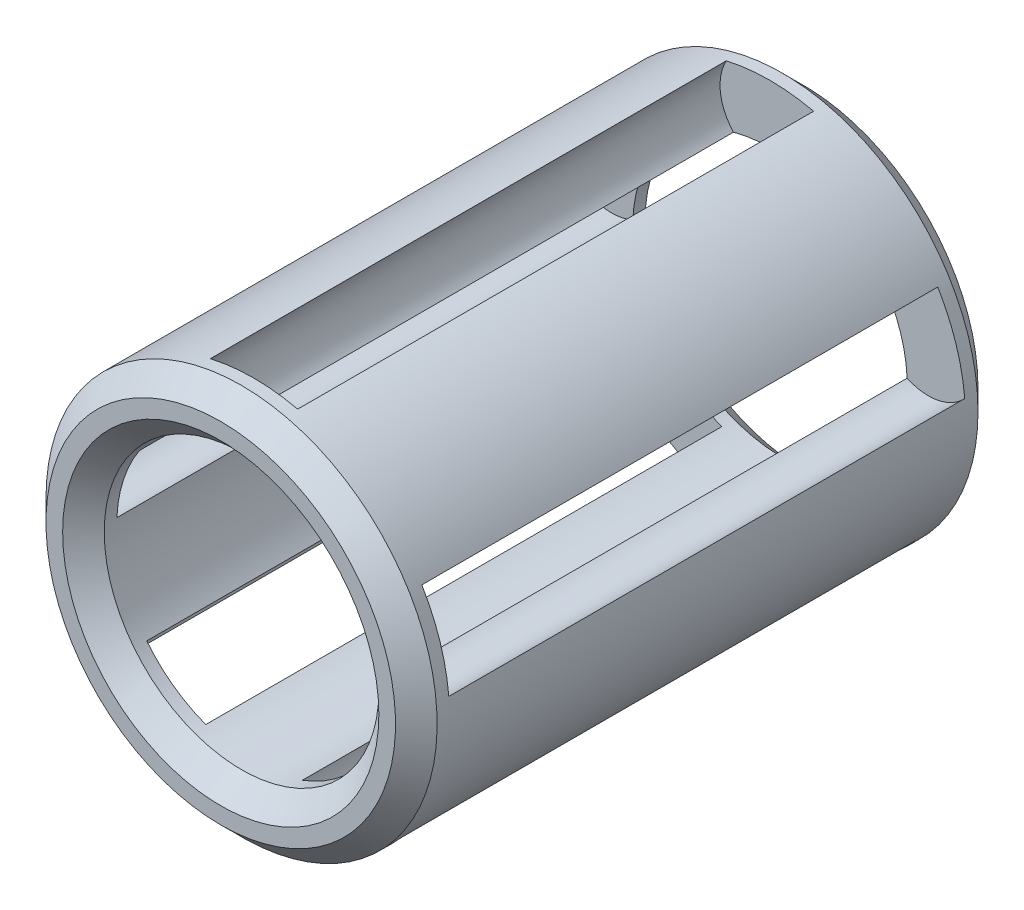
ISO-10303-21;
HEADER;
FILE_DESCRIPTION(('STEP AP214'),'2;1');
FILE_NAME('part.step','',(''),(''),'','','');
FILE_SCHEMA(('AUTOMOTIVE_DESIGN { 1 0 10303 214 1 1 1 1 }'));
ENDSEC;
DATA;
#1=APPLICATION_CONTEXT('core data for automotive mechanical design processes');
#2=APPLICATION_PROTOCOL_DEFINITION('international standard','automotive_design',2000,#1);
#3=PRODUCT_CONTEXT('',#1,'mechanical');
#4=PRODUCT('Part','Part','',(#3));
#5=PRODUCT_RELATED_PRODUCT_CATEGORY('part','',(#4));
#6=PRODUCT_DEFINITION_FORMATION('','',#4);
#7=PRODUCT_DEFINITION_CONTEXT('part definition',#1,'design');
#8=PRODUCT_DEFINITION('design','',#6,#7);
#9=PRODUCT_DEFINITION_SHAPE('','',#8);
#10=(LENGTH_UNIT() NAMED_UNIT(*) SI_UNIT(.MILLI.,.METRE.));
#11=(NAMED_UNIT(*) PLANE_ANGLE_UNIT() SI_UNIT($,.RADIAN.));
#12=(NAMED_UNIT(*) SI_UNIT($,.STERADIAN.) SOLID_ANGLE_UNIT());
#13=UNCERTAINTY_MEASURE_WITH_UNIT(LENGTH_MEASURE(1.E-05),#10,'distance_accuracy_value','');
#14=(GEOMETRIC_REPRESENTATION_CONTEXT(3) GLOBAL_UNCERTAINTY_ASSIGNED_CONTEXT((#13)) GLOBAL_UNIT_ASSIGNED_CONTEXT((#10,
#11,#12)) REPRESENTATION_CONTEXT('',''));
#15=CARTESIAN_POINT('',(0.,0.,0.));
#16=DIRECTION('',(0.,0.,1.));
#17=DIRECTION('',(1.,0.,0.));
#18=AXIS2_PLACEMENT_3D('',#15,#16,#17);
#19=CARTESIAN_POINT('',(0.,0.,-3.50000000003092));
#20=DIRECTION('',(0.,0.,-1.));
#21=DIRECTION('',(-1.,0.,0.));
#22=AXIS2_PLACEMENT_3D('',#19,#20,#21);
#23=CONICAL_SURFACE('',#22,1.90000000003465,0.785398163397448);
#24=CARTESIAN_POINT('',(0.,0.,-3.50000000003092));
#25=DIRECTION('',(0.,0.,-1.));
#26=DIRECTION('',(-1.,0.,0.));
#27=AXIS2_PLACEMENT_3D('',#24,#25,#26);
#28=CIRCLE('',#27,1.90000000003465);
#29=CARTESIAN_POINT('',(-1.90000000003465,0.,-3.50000000003092));
#30=VERTEX_POINT('',#29);
#31=EDGE_CURVE('E197',#30,#30,#28,.T.);
#32=ORIENTED_EDGE('',*,*,#31,.T.);
#33=EDGE_LOOP('',(#32));
#34=FACE_BOUND('',#33,.T.);
#35=CARTESIAN_POINT('',(0.,0.,-3.25));
#36=DIRECTION('',(0.,0.,-1.));
#37=DIRECTION('',(-1.,0.,0.));
#38=AXIS2_PLACEMENT_3D('',#35,#36,#37);
#39=CIRCLE('',#38,1.65);
#40=CARTESIAN_POINT('',(-1.65,0.,-3.25));
#41=VERTEX_POINT('',#40);
#42=EDGE_CURVE('E194',#41,#41,#39,.F.);
#43=ORIENTED_EDGE('',*,*,#42,.T.);
#44=EDGE_LOOP('',(#43));
#45=FACE_BOUND('',#44,.T.);
#46=ADVANCED_FACE('F17',(#34,#45),#23,.F.);
#47=CARTESIAN_POINT('',(0.,0.,3.50000000003092));
#48=DIRECTION('',(0.,0.,1.));
#49=DIRECTION('',(1.,0.,0.));
#50=AXIS2_PLACEMENT_3D('',#47,#48,#49);
#51=CONICAL_SURFACE('',#50,1.90000000003465,0.785398163397448);
#52=CARTESIAN_POINT('',(0.,0.,3.50000000003092));
#53=DIRECTION('',(0.,0.,1.));
#54=DIRECTION('',(1.,0.,0.));
#55=AXIS2_PLACEMENT_3D('',#52,#53,#54);
#56=CIRCLE('',#55,1.90000000003465);
#57=CARTESIAN_POINT('',(1.90000000003465,0.,3.50000000003092));
#58=VERTEX_POINT('',#57);
#59=EDGE_CURVE('E20',#58,#58,#56,.T.);
#60=ORIENTED_EDGE('',*,*,#59,.T.);
#61=EDGE_LOOP('',(#60));
#62=FACE_BOUND('',#61,.T.);
#63=CARTESIAN_POINT('',(0.,0.,3.25));
#64=DIRECTION('',(0.,0.,-1.));
#65=DIRECTION('',(-1.,0.,0.));
#66=AXIS2_PLACEMENT_3D('',#63,#64,#65);
#67=CIRCLE('',#66,1.65);
#68=CARTESIAN_POINT('',(-1.65,0.,3.25));
#69=VERTEX_POINT('',#68);
#70=EDGE_CURVE('E190',#69,#69,#67,.T.);
#71=ORIENTED_EDGE('',*,*,#70,.T.);
#72=EDGE_LOOP('',(#71));
#73=FACE_BOUND('',#72,.T.);
#74=ADVANCED_FACE('F329',(#62,#73),#51,.F.);
#75=CARTESIAN_POINT('',(0.,0.,3.5));
#76=DIRECTION('',(0.,0.,-1.));
#77=DIRECTION('',(-1.,0.,0.));
#78=AXIS2_PLACEMENT_3D('',#75,#76,#77);
#79=PLANE('',#78);
#80=ORIENTED_EDGE('',*,*,#59,.F.);
#81=EDGE_LOOP('',(#80));
#82=FACE_BOUND('',#81,.T.);
#83=CARTESIAN_POINT('',(0.,0.,3.49999999991724));
#84=DIRECTION('',(0.,0.,-1.));
#85=DIRECTION('',(0.,1.,0.));
#86=AXIS2_PLACEMENT_3D('',#83,#84,#85);
#87=CIRCLE('',#86,2.09999999998445);
#88=CARTESIAN_POINT('',(0.,2.09999999998445,3.49999999991724));
#89=VERTEX_POINT('',#88);
#90=EDGE_CURVE('E193',#89,#89,#87,.T.);
#91=ORIENTED_EDGE('',*,*,#90,.F.);
#92=EDGE_LOOP('',(#91));
#93=FACE_BOUND('',#92,.T.);
#94=ADVANCED_FACE('F332',(#82,#93),#79,.F.);
#95=CARTESIAN_POINT('',(0.,0.,-3.5));
#96=DIRECTION('',(0.,0.,1.));
#97=DIRECTION('',(1.,0.,0.));
#98=AXIS2_PLACEMENT_3D('',#95,#96,#97);
#99=PLANE('',#98);
#100=ORIENTED_EDGE('',*,*,#31,.F.);
#101=EDGE_LOOP('',(#100));
#102=FACE_BOUND('',#101,.T.);
#103=CARTESIAN_POINT('',(0.,0.,-3.50000000003092));
#104=DIRECTION('',(0.,0.,1.));
#105=DIRECTION('',(1.,0.,0.));
#106=AXIS2_PLACEMENT_3D('',#103,#104,#105);
#107=CIRCLE('',#106,2.09999999998445);
#108=CARTESIAN_POINT('',(2.09999999998445,0.,-3.50000000003092));
#109=VERTEX_POINT('',#108);
#110=EDGE_CURVE('E229',#109,#109,#107,.T.);
#111=ORIENTED_EDGE('',*,*,#110,.F.);
#112=EDGE_LOOP('',(#111));
#113=FACE_BOUND('',#112,.T.);
#114=ADVANCED_FACE('F335',(#102,#113),#99,.F.);
#115=CARTESIAN_POINT('',(0.,0.,-3.1));
#116=DIRECTION('',(0.,0.,-1.));
#117=DIRECTION('',(-1.,0.,0.));
#118=AXIS2_PLACEMENT_3D('',#115,#116,#117);
#119=CYLINDRICAL_SURFACE('',#118,1.65);
#120=ORIENTED_EDGE('',*,*,#70,.F.);
#121=EDGE_LOOP('',(#120));
#122=FACE_BOUND('',#121,.T.);
#123=DIRECTION('',(0.,0.,-1.));
#124=VECTOR('',#123,1.);
#125=CARTESIAN_POINT('',(0.580072192135739,-1.54467350981068,-3.1));
#126=LINE('',#125,#124);
#127=CARTESIAN_POINT('',(0.580072192135739,-1.54467350981068,3.1));
#128=VERTEX_POINT('',#127);
#129=CARTESIAN_POINT('',(0.580072192135739,-1.54467350981068,-3.1));
#130=VERTEX_POINT('',#129);
#131=EDGE_CURVE('E220',#128,#130,#126,.T.);
#132=ORIENTED_EDGE('',*,*,#131,.T.);
#133=CARTESIAN_POINT('',(0.,0.,-3.1));
#134=DIRECTION('',(0.,0.,-1.));
#135=DIRECTION('',(-1.,0.,0.));
#136=AXIS2_PLACEMENT_3D('',#133,#134,#135);
#137=CIRCLE('',#136,1.65);
#138=CARTESIAN_POINT('',(1.28981964171965,-1.02901180354464,-3.1));
#139=VERTEX_POINT('',#138);
#140=EDGE_CURVE('E223',#139,#130,#137,.T.);
#141=ORIENTED_EDGE('',*,*,#140,.F.);
#142=DIRECTION('',(0.,0.,-1.));
#143=VECTOR('',#142,1.);
#144=CARTESIAN_POINT('',(1.28981964171965,-1.02901180354464,-3.1));
#145=LINE('',#144,#143);
#146=CARTESIAN_POINT('',(1.28981964171965,-1.02901180354464,3.1));
#147=VERTEX_POINT('',#146);
#148=EDGE_CURVE('E224',#139,#147,#145,.F.);
#149=ORIENTED_EDGE('',*,*,#148,.T.);
#150=CARTESIAN_POINT('',(0.,0.,3.1));
#151=DIRECTION('',(0.,0.,-1.));
#152=DIRECTION('',(-1.,0.,0.));
#153=AXIS2_PLACEMENT_3D('',#150,#151,#152);
#154=CIRCLE('',#153,1.65);
#155=EDGE_CURVE('E227',#128,#147,#154,.F.);
#156=ORIENTED_EDGE('',*,*,#155,.F.);
#157=EDGE_LOOP('',(#132,#141,#149,#156));
#158=FACE_BOUND('',#157,.T.);
#159=DIRECTION('',(0.,0.,-1.));
#160=VECTOR('',#159,1.);
#161=CARTESIAN_POINT('',(-1.28981964171968,-1.0290118035446,-3.1));
#162=LINE('',#161,#160);
#163=CARTESIAN_POINT('',(-1.28981964171968,-1.0290118035446,3.1));
#164=VERTEX_POINT('',#163);
#165=CARTESIAN_POINT('',(-1.28981964171968,-1.0290118035446,-3.1));
#166=VERTEX_POINT('',#165);
#167=EDGE_CURVE('E230',#164,#166,#162,.T.);
#168=ORIENTED_EDGE('',*,*,#167,.T.);
#169=CARTESIAN_POINT('',(0.,0.,-3.1));
#170=DIRECTION('',(0.,0.,-1.));
#171=DIRECTION('',(-1.,0.,0.));
#172=AXIS2_PLACEMENT_3D('',#169,#170,#171);
#173=CIRCLE('',#172,1.65);
#174=CARTESIAN_POINT('',(-0.580072192135791,-1.54467350981066,-3.1));
#175=VERTEX_POINT('',#174);
#176=EDGE_CURVE('E162',#175,#166,#173,.T.);
#177=ORIENTED_EDGE('',*,*,#176,.F.);
#178=DIRECTION('',(0.,0.,-1.));
#179=VECTOR('',#178,1.);
#180=CARTESIAN_POINT('',(-0.580072192135791,-1.54467350981066,-3.1));
#181=LINE('',#180,#179);
#182=CARTESIAN_POINT('',(-0.580072192135791,-1.54467350981066,3.1));
#183=VERTEX_POINT('',#182);
#184=EDGE_CURVE('E158',#175,#183,#181,.F.);
#185=ORIENTED_EDGE('',*,*,#184,.T.);
#186=CARTESIAN_POINT('',(0.,0.,3.1));
#187=DIRECTION('',(0.,0.,-1.));
#188=DIRECTION('',(-1.,0.,0.));
#189=AXIS2_PLACEMENT_3D('',#186,#187,#188);
#190=CIRCLE('',#189,1.65);
#191=EDGE_CURVE('E312',#164,#183,#190,.F.);
#192=ORIENTED_EDGE('',*,*,#191,.F.);
#193=EDGE_LOOP('',(#168,#177,#185,#192));
#194=FACE_BOUND('',#193,.T.);
#195=DIRECTION('',(0.,0.,-1.));
#196=VECTOR('',#195,1.);
#197=CARTESIAN_POINT('',(0.438648047271413,1.59062499999999,-3.1));
#198=LINE('',#197,#196);
#199=CARTESIAN_POINT('',(0.438648047271414,1.59062499999999,3.1));
#200=VERTEX_POINT('',#199);
#201=CARTESIAN_POINT('',(0.438648047271414,1.59062499999999,-3.1));
#202=VERTEX_POINT('',#201);
#203=EDGE_CURVE('E204',#200,#202,#198,.T.);
#204=ORIENTED_EDGE('',*,*,#203,.T.);
#205=CARTESIAN_POINT('',(0.,0.,-3.1));
#206=DIRECTION('',(0.,0.,-1.));
#207=DIRECTION('',(-1.,0.,0.));
#208=AXIS2_PLACEMENT_3D('',#205,#206,#207);
#209=CIRCLE('',#208,1.65);
#210=CARTESIAN_POINT('',(-0.438648047271386,1.590625,-3.1));
#211=VERTEX_POINT('',#210);
#212=EDGE_CURVE('E207',#211,#202,#209,.T.);
#213=ORIENTED_EDGE('',*,*,#212,.F.);
#214=DIRECTION('',(0.,0.,-1.));
#215=VECTOR('',#214,1.);
#216=CARTESIAN_POINT('',(-0.438648047271386,1.590625,-3.1));
#217=LINE('',#216,#215);
#218=CARTESIAN_POINT('',(-0.438648047271386,1.590625,3.1));
#219=VERTEX_POINT('',#218);
#220=EDGE_CURVE('E208',#211,#219,#217,.F.);
#221=ORIENTED_EDGE('',*,*,#220,.T.);
#222=CARTESIAN_POINT('',(0.,0.,3.1));
#223=DIRECTION('',(0.,0.,-1.));
#224=DIRECTION('',(-1.,0.,0.));
#225=AXIS2_PLACEMENT_3D('',#222,#223,#224);
#226=CIRCLE('',#225,1.65);
#227=EDGE_CURVE('E211',#200,#219,#226,.F.);
#228=ORIENTED_EDGE('',*,*,#227,.F.);
#229=EDGE_LOOP('',(#204,#213,#221,#228));
#230=FACE_BOUND('',#229,.T.);
#231=DIRECTION('',(0.,0.,-1.));
#232=VECTOR('',#231,1.);
#233=CARTESIAN_POINT('',(1.64832397238822,0.07435107296002,-3.1));
#234=LINE('',#233,#232);
#235=CARTESIAN_POINT('',(1.64832397238822,0.0743510729600193,3.1));
#236=VERTEX_POINT('',#235);
#237=CARTESIAN_POINT('',(1.64832397238822,0.0743510729600193,-3.1));
#238=VERTEX_POINT('',#237);
#239=EDGE_CURVE('E212',#236,#238,#234,.T.);
#240=ORIENTED_EDGE('',*,*,#239,.T.);
#241=CARTESIAN_POINT('',(0.,0.,-3.1));
#242=DIRECTION('',(0.,0.,-1.));
#243=DIRECTION('',(-1.,0.,0.));
#244=AXIS2_PLACEMENT_3D('',#241,#242,#243);
#245=CIRCLE('',#244,1.65);
#246=CARTESIAN_POINT('',(1.37722457007574,0.908709240395242,-3.1));
#247=VERTEX_POINT('',#246);
#248=EDGE_CURVE('E215',#247,#238,#245,.T.);
#249=ORIENTED_EDGE('',*,*,#248,.F.);
#250=DIRECTION('',(0.,0.,-1.));
#251=VECTOR('',#250,1.);
#252=CARTESIAN_POINT('',(1.37722457007574,0.908709240395244,-3.1));
#253=LINE('',#252,#251);
#254=CARTESIAN_POINT('',(1.37722457007574,0.908709240395242,3.1));
#255=VERTEX_POINT('',#254);
#256=EDGE_CURVE('E216',#247,#255,#253,.F.);
#257=ORIENTED_EDGE('',*,*,#256,.T.);
#258=CARTESIAN_POINT('',(0.,0.,3.1));
#259=DIRECTION('',(0.,0.,-1.));
#260=DIRECTION('',(-1.,0.,0.));
#261=AXIS2_PLACEMENT_3D('',#258,#259,#260);
#262=CIRCLE('',#261,1.65);
#263=EDGE_CURVE('E219',#236,#255,#262,.F.);
#264=ORIENTED_EDGE('',*,*,#263,.F.);
#265=EDGE_LOOP('',(#240,#249,#257,#264));
#266=FACE_BOUND('',#265,.T.);
#267=CARTESIAN_POINT('',(0.,0.,-3.1));
#268=DIRECTION('',(0.,0.,-1.));
#269=DIRECTION('',(-1.,0.,0.));
#270=AXIS2_PLACEMENT_3D('',#267,#268,#269);
#271=CIRCLE('',#270,1.65);
#272=CARTESIAN_POINT('',(-1.64832397238822,0.0743510729600743,-3.1));
#273=VERTEX_POINT('',#272);
#274=CARTESIAN_POINT('',(-1.37722457007572,0.908709240395266,-3.1));
#275=VERTEX_POINT('',#274);
#276=EDGE_CURVE('E189',#273,#275,#271,.T.);
#277=ORIENTED_EDGE('',*,*,#276,.F.);
#278=DIRECTION('',(0.,0.,-1.));
#279=VECTOR('',#278,1.);
#280=CARTESIAN_POINT('',(-1.64832397238822,0.0743510729600742,-3.1));
#281=LINE('',#280,#279);
#282=CARTESIAN_POINT('',(-1.64832397238822,0.0743510729600743,3.1));
#283=VERTEX_POINT('',#282);
#284=EDGE_CURVE('E200',#273,#283,#281,.F.);
#285=ORIENTED_EDGE('',*,*,#284,.T.);
#286=CARTESIAN_POINT('',(0.,0.,3.1));
#287=DIRECTION('',(0.,0.,-1.));
#288=DIRECTION('',(-1.,0.,0.));
#289=AXIS2_PLACEMENT_3D('',#286,#287,#288);
#290=CIRCLE('',#289,1.65);
#291=CARTESIAN_POINT('',(-1.37722457007572,0.908709240395266,3.1));
#292=VERTEX_POINT('',#291);
#293=EDGE_CURVE('E203',#292,#283,#290,.F.);
#294=ORIENTED_EDGE('',*,*,#293,.F.);
#295=DIRECTION('',(0.,0.,-1.));
#296=VECTOR('',#295,1.);
#297=CARTESIAN_POINT('',(-1.37722457007572,0.908709240395266,-3.1));
#298=LINE('',#297,#296);
#299=EDGE_CURVE('E187',#292,#275,#298,.T.);
#300=ORIENTED_EDGE('',*,*,#299,.T.);
#301=EDGE_LOOP('',(#277,#285,#294,#300));
#302=FACE_BOUND('',#301,.T.);
#303=ORIENTED_EDGE('',*,*,#42,.F.);
#304=EDGE_LOOP('',(#303));
#305=FACE_BOUND('',#304,.T.);
#306=ADVANCED_FACE('F343',(#122,#158,#194,#230,#266,#302,#305),#119,.F.);
#307=CARTESIAN_POINT('',(0.,0.,3.24999999992315));
#308=DIRECTION('',(0.,0.,-1.));
#309=DIRECTION('',(0.,1.,0.));
#310=AXIS2_PLACEMENT_3D('',#307,#308,#309);
#311=CONICAL_SURFACE('',#310,2.34999999997854,0.785398163397448);
#312=ORIENTED_EDGE('',*,*,#90,.T.);
#313=EDGE_LOOP('',(#312));
#314=FACE_BOUND('',#313,.T.);
#315=CARTESIAN_POINT('',(0.,0.,3.25));
#316=DIRECTION('',(0.,0.,-1.));
#317=DIRECTION('',(-1.,0.,0.));
#318=AXIS2_PLACEMENT_3D('',#315,#316,#317);
#319=CIRCLE('',#318,2.35);
#320=CARTESIAN_POINT('',(-2.35,0.,3.25));
#321=VERTEX_POINT('',#320);
#322=EDGE_CURVE('E182',#321,#321,#319,.T.);
#323=ORIENTED_EDGE('',*,*,#322,.F.);
#324=EDGE_LOOP('',(#323));
#325=FACE_BOUND('',#324,.T.);
#326=ADVANCED_FACE('F339',(#314,#325),#311,.T.);
#327=CARTESIAN_POINT('',(0.,0.,-3.25000000003683));
#328=DIRECTION('',(0.,0.,1.));
#329=DIRECTION('',(1.,0.,0.));
#330=AXIS2_PLACEMENT_3D('',#327,#328,#329);
#331=CONICAL_SURFACE('',#330,2.34999999997854,0.785398163397448);
#332=ORIENTED_EDGE('',*,*,#110,.T.);
#333=EDGE_LOOP('',(#332));
#334=FACE_BOUND('',#333,.T.);
#335=CARTESIAN_POINT('',(0.,0.,-3.25));
#336=DIRECTION('',(0.,0.,-1.));
#337=DIRECTION('',(-1.,0.,0.));
#338=AXIS2_PLACEMENT_3D('',#335,#336,#337);
#339=CIRCLE('',#338,2.35);
#340=CARTESIAN_POINT('',(-2.35,0.,-3.25));
#341=VERTEX_POINT('',#340);
#342=EDGE_CURVE('E179',#341,#341,#339,.F.);
#343=ORIENTED_EDGE('',*,*,#342,.F.);
#344=EDGE_LOOP('',(#343));
#345=FACE_BOUND('',#344,.T.);
#346=ADVANCED_FACE('F342',(#334,#345),#331,.T.);
#347=CARTESIAN_POINT('',(-1.17557050458496,-1.61803398874988,-3.1));
#348=DIRECTION('',(0.,0.,-1.));
#349=DIRECTION('',(-1.,0.,0.));
#350=AXIS2_PLACEMENT_3D('',#347,#348,#349);
#351=CYLINDRICAL_SURFACE('',#350,0.6);
#352=DIRECTION('',(0.,0.,-1.));
#353=VECTOR('',#352,1.);
#354=CARTESIAN_POINT('',(-0.921729395941449,-2.16169260549631,-3.1));
#355=LINE('',#354,#353);
#356=CARTESIAN_POINT('',(-0.921729395941452,-2.16169260549631,3.1));
#357=VERTEX_POINT('',#356);
#358=CARTESIAN_POINT('',(-0.921729395941452,-2.16169260549631,-3.1));
#359=VERTEX_POINT('',#358);
#360=EDGE_CURVE('E156',#357,#359,#355,.T.);
#361=ORIENTED_EDGE('',*,*,#360,.F.);
#362=CARTESIAN_POINT('',(-1.17557050458496,-1.61803398874988,3.1));
#363=DIRECTION('',(0.,0.,-1.));
#364=DIRECTION('',(-1.,0.,0.));
#365=AXIS2_PLACEMENT_3D('',#362,#363,#364);
#366=CIRCLE('',#365,0.6);
#367=EDGE_CURVE('E310',#183,#357,#366,.T.);
#368=ORIENTED_EDGE('',*,*,#367,.F.);
#369=ORIENTED_EDGE('',*,*,#184,.F.);
#370=CARTESIAN_POINT('',(-1.17557050458496,-1.61803398874988,-3.1));
#371=DIRECTION('',(0.,0.,-1.));
#372=DIRECTION('',(-1.,0.,0.));
#373=AXIS2_PLACEMENT_3D('',#370,#371,#372);
#374=CIRCLE('',#373,0.6);
#375=EDGE_CURVE('E151',#359,#175,#374,.F.);
#376=ORIENTED_EDGE('',*,*,#375,.F.);
#377=EDGE_LOOP('',(#361,#368,#369,#376));
#378=FACE_BOUND('',#377,.T.);
#379=ADVANCED_FACE('F153',(#378),#351,.F.);
#380=CARTESIAN_POINT('',(0.,0.,-3.1));
#381=DIRECTION('',(0.,0.,1.));
#382=DIRECTION('',(1.,0.,0.));
#383=AXIS2_PLACEMENT_3D('',#380,#381,#382);
#384=PLANE('',#383);
#385=ORIENTED_EDGE('',*,*,#375,.T.);
#386=ORIENTED_EDGE('',*,*,#176,.T.);
#387=CARTESIAN_POINT('',(-1.17557050458479,-1.61803398874982,-3.1));
#388=DIRECTION('',(0.,0.,-1.));
#389=DIRECTION('',(-1.,0.,0.));
#390=AXIS2_PLACEMENT_3D('',#387,#388,#389);
#391=CIRCLE('',#390,0.6);
#392=CARTESIAN_POINT('',(-1.77106179112333,-1.54461649998406,-3.1));
#393=VERTEX_POINT('',#392);
#394=EDGE_CURVE('E168',#166,#393,#391,.F.);
#395=ORIENTED_EDGE('',*,*,#394,.T.);
#396=CARTESIAN_POINT('',(0.,0.,-3.1));
#397=DIRECTION('',(0.,0.,-1.));
#398=DIRECTION('',(-1.,0.,0.));
#399=AXIS2_PLACEMENT_3D('',#396,#397,#398);
#400=CIRCLE('',#399,2.35);
#401=EDGE_CURVE('E165',#359,#393,#400,.T.);
#402=ORIENTED_EDGE('',*,*,#401,.F.);
#403=EDGE_LOOP('',(#385,#386,#395,#402));
#404=FACE_BOUND('',#403,.T.);
#405=ADVANCED_FACE('F166',(#404),#384,.T.);
#406=CARTESIAN_POINT('',(-1.17557050458479,-1.61803398874982,-3.1));
#407=DIRECTION('',(0.,0.,-1.));
#408=DIRECTION('',(-1.,0.,0.));
#409=AXIS2_PLACEMENT_3D('',#406,#407,#408);
#410=CYLINDRICAL_SURFACE('',#409,0.6);
#411=DIRECTION('',(0.,0.,-1.));
#412=VECTOR('',#411,1.);
#413=CARTESIAN_POINT('',(-1.77106179112333,-1.54461649998407,-3.1));
#414=LINE('',#413,#412);
#415=CARTESIAN_POINT('',(-1.77106179112333,-1.54461649998406,3.1));
#416=VERTEX_POINT('',#415);
#417=EDGE_CURVE('E172',#393,#416,#414,.F.);
#418=ORIENTED_EDGE('',*,*,#417,.F.);
#419=ORIENTED_EDGE('',*,*,#394,.F.);
#420=ORIENTED_EDGE('',*,*,#167,.F.);
#421=CARTESIAN_POINT('',(-1.17557050458479,-1.61803398874982,3.1));
#422=DIRECTION('',(0.,0.,-1.));
#423=DIRECTION('',(-1.,0.,0.));
#424=AXIS2_PLACEMENT_3D('',#421,#422,#423);
#425=CIRCLE('',#424,0.6);
#426=EDGE_CURVE('E315',#416,#164,#425,.T.);
#427=ORIENTED_EDGE('',*,*,#426,.F.);
#428=EDGE_LOOP('',(#418,#419,#420,#427));
#429=FACE_BOUND('',#428,.T.);
#430=ADVANCED_FACE('F467',(#429),#410,.F.);
#431=CARTESIAN_POINT('',(0.,0.,3.1));
#432=DIRECTION('',(0.,0.,-1.));
#433=DIRECTION('',(-1.,0.,0.));
#434=AXIS2_PLACEMENT_3D('',#431,#432,#433);
#435=PLANE('',#434);
#436=ORIENTED_EDGE('',*,*,#191,.T.);
#437=ORIENTED_EDGE('',*,*,#367,.T.);
#438=CARTESIAN_POINT('',(0.,0.,3.1));
#439=DIRECTION('',(0.,0.,-1.));
#440=DIRECTION('',(-1.,0.,0.));
#441=AXIS2_PLACEMENT_3D('',#438,#439,#440);
#442=CIRCLE('',#441,2.35);
#443=EDGE_CURVE('E178',#416,#357,#442,.F.);
#444=ORIENTED_EDGE('',*,*,#443,.F.);
#445=ORIENTED_EDGE('',*,*,#426,.T.);
#446=EDGE_LOOP('',(#436,#437,#444,#445));
#447=FACE_BOUND('',#446,.T.);
#448=ADVANCED_FACE('F464',(#447),#435,.T.);
#449=CARTESIAN_POINT('',(0.,0.,3.1));
#450=DIRECTION('',(0.,0.,-1.));
#451=DIRECTION('',(-1.,0.,0.));
#452=AXIS2_PLACEMENT_3D('',#449,#450,#451);
#453=PLANE('',#452);
#454=ORIENTED_EDGE('',*,*,#155,.T.);
#455=CARTESIAN_POINT('',(1.17557050458494,-1.6180339887499,3.1));
#456=DIRECTION('',(0.,0.,-1.));
#457=DIRECTION('',(-1.,0.,0.));
#458=AXIS2_PLACEMENT_3D('',#455,#456,#457);
#459=CIRCLE('',#458,0.6);
#460=CARTESIAN_POINT('',(1.77106179112345,-1.54461649998392,3.1));
#461=VERTEX_POINT('',#460);
#462=EDGE_CURVE('E226',#147,#461,#459,.T.);
#463=ORIENTED_EDGE('',*,*,#462,.T.);
#464=CARTESIAN_POINT('',(0.,0.,3.1));
#465=DIRECTION('',(0.,0.,-1.));
#466=DIRECTION('',(-1.,0.,0.));
#467=AXIS2_PLACEMENT_3D('',#464,#465,#466);
#468=CIRCLE('',#467,2.35);
#469=CARTESIAN_POINT('',(0.921729395941621,-2.16169260549623,3.1));
#470=VERTEX_POINT('',#469);
#471=EDGE_CURVE('E259',#470,#461,#468,.F.);
#472=ORIENTED_EDGE('',*,*,#471,.F.);
#473=CARTESIAN_POINT('',(1.17557050458493,-1.61803398874972,3.1));
#474=DIRECTION('',(0.,0.,-1.));
#475=DIRECTION('',(-1.,0.,0.));
#476=AXIS2_PLACEMENT_3D('',#473,#474,#475);
#477=CIRCLE('',#476,0.6);
#478=EDGE_CURVE('E298',#470,#128,#477,.T.);
#479=ORIENTED_EDGE('',*,*,#478,.T.);
#480=EDGE_LOOP('',(#454,#463,#472,#479));
#481=FACE_BOUND('',#480,.T.);
#482=ADVANCED_FACE('F372',(#481),#453,.T.);
#483=CARTESIAN_POINT('',(1.17557050458494,-1.6180339887499,-3.1));
#484=DIRECTION('',(0.,0.,-1.));
#485=DIRECTION('',(-1.,0.,0.));
#486=AXIS2_PLACEMENT_3D('',#483,#484,#485);
#487=CYLINDRICAL_SURFACE('',#486,0.6);
#488=DIRECTION('',(0.,0.,-1.));
#489=VECTOR('',#488,1.);
#490=CARTESIAN_POINT('',(1.77106179112345,-1.54461649998392,-3.1));
#491=LINE('',#490,#489);
#492=CARTESIAN_POINT('',(1.77106179112345,-1.54461649998392,-3.1));
#493=VERTEX_POINT('',#492);
#494=EDGE_CURVE('E258',#461,#493,#491,.T.);
#495=ORIENTED_EDGE('',*,*,#494,.F.);
#496=ORIENTED_EDGE('',*,*,#462,.F.);
#497=ORIENTED_EDGE('',*,*,#148,.F.);
#498=CARTESIAN_POINT('',(1.17557050458494,-1.6180339887499,-3.1));
#499=DIRECTION('',(0.,0.,-1.));
#500=DIRECTION('',(-1.,0.,0.));
#501=AXIS2_PLACEMENT_3D('',#498,#499,#500);
#502=CIRCLE('',#501,0.6);
#503=EDGE_CURVE('E304',#493,#139,#502,.F.);
#504=ORIENTED_EDGE('',*,*,#503,.F.);
#505=EDGE_LOOP('',(#495,#496,#497,#504));
#506=FACE_BOUND('',#505,.T.);
#507=ADVANCED_FACE('F376',(#506),#487,.F.);
#508=CARTESIAN_POINT('',(0.,0.,-3.1));
#509=DIRECTION('',(0.,0.,1.));
#510=DIRECTION('',(1.,0.,0.));
#511=AXIS2_PLACEMENT_3D('',#508,#509,#510);
#512=PLANE('',#511);
#513=ORIENTED_EDGE('',*,*,#503,.T.);
#514=ORIENTED_EDGE('',*,*,#140,.T.);
#515=CARTESIAN_POINT('',(1.17557050458493,-1.61803398874972,-3.1));
#516=DIRECTION('',(0.,0.,-1.));
#517=DIRECTION('',(-1.,0.,0.));
#518=AXIS2_PLACEMENT_3D('',#515,#516,#517);
#519=CIRCLE('',#518,0.6);
#520=CARTESIAN_POINT('',(0.92172939594162,-2.16169260549623,-3.1));
#521=VERTEX_POINT('',#520);
#522=EDGE_CURVE('E222',#130,#521,#519,.F.);
#523=ORIENTED_EDGE('',*,*,#522,.T.);
#524=CARTESIAN_POINT('',(0.,0.,-3.1));
#525=DIRECTION('',(0.,0.,-1.));
#526=DIRECTION('',(-1.,0.,0.));
#527=AXIS2_PLACEMENT_3D('',#524,#525,#526);
#528=CIRCLE('',#527,2.35);
#529=EDGE_CURVE('E255',#493,#521,#528,.T.);
#530=ORIENTED_EDGE('',*,*,#529,.F.);
#531=EDGE_LOOP('',(#513,#514,#523,#530));
#532=FACE_BOUND('',#531,.T.);
#533=ADVANCED_FACE('F379',(#532),#512,.T.);
#534=CARTESIAN_POINT('',(1.17557050458493,-1.61803398874972,-3.1));
#535=DIRECTION('',(0.,0.,-1.));
#536=DIRECTION('',(-1.,0.,0.));
#537=AXIS2_PLACEMENT_3D('',#534,#535,#536);
#538=CYLINDRICAL_SURFACE('',#537,0.6);
#539=DIRECTION('',(0.,0.,-1.));
#540=VECTOR('',#539,1.);
#541=CARTESIAN_POINT('',(0.921729395941622,-2.16169260549623,-3.1));
#542=LINE('',#541,#540);
#543=EDGE_CURVE('E254',#521,#470,#542,.F.);
#544=ORIENTED_EDGE('',*,*,#543,.F.);
#545=ORIENTED_EDGE('',*,*,#522,.F.);
#546=ORIENTED_EDGE('',*,*,#131,.F.);
#547=ORIENTED_EDGE('',*,*,#478,.F.);
#548=EDGE_LOOP('',(#544,#545,#546,#547));
#549=FACE_BOUND('',#548,.T.);
#550=ADVANCED_FACE('F369',(#549),#538,.F.);
#551=CARTESIAN_POINT('',(0.,0.,3.1));
#552=DIRECTION('',(0.,0.,-1.));
#553=DIRECTION('',(-1.,0.,0.));
#554=AXIS2_PLACEMENT_3D('',#551,#552,#553);
#555=PLANE('',#554);
#556=ORIENTED_EDGE('',*,*,#263,.T.);
#557=CARTESIAN_POINT('',(1.90211303259031,0.61803398874989,3.1));
#558=DIRECTION('',(0.,0.,-1.));
#559=DIRECTION('',(-1.,0.,0.));
#560=AXIS2_PLACEMENT_3D('',#557,#558,#559);
#561=CIRCLE('',#560,0.6);
#562=CARTESIAN_POINT('',(2.016305779032,1.20706710892235,3.1));
#563=VERTEX_POINT('',#562);
#564=EDGE_CURVE('E218',#255,#563,#561,.T.);
#565=ORIENTED_EDGE('',*,*,#564,.T.);
#566=CARTESIAN_POINT('',(0.,0.,3.1));
#567=DIRECTION('',(0.,0.,-1.));
#568=DIRECTION('',(-1.,0.,0.));
#569=AXIS2_PLACEMENT_3D('',#566,#567,#568);
#570=CIRCLE('',#569,2.35);
#571=CARTESIAN_POINT('',(2.34072188624516,0.208616996558089,3.1));
#572=VERTEX_POINT('',#571);
#573=EDGE_CURVE('E251',#572,#563,#570,.F.);
#574=ORIENTED_EDGE('',*,*,#573,.F.);
#575=CARTESIAN_POINT('',(1.90211303259013,0.618033988749942,3.1));
#576=DIRECTION('',(0.,0.,-1.));
#577=DIRECTION('',(-1.,0.,0.));
#578=AXIS2_PLACEMENT_3D('',#575,#576,#577);
#579=CIRCLE('',#578,0.6);
#580=EDGE_CURVE('E286',#572,#236,#579,.T.);
#581=ORIENTED_EDGE('',*,*,#580,.T.);
#582=EDGE_LOOP('',(#556,#565,#574,#581));
#583=FACE_BOUND('',#582,.T.);
#584=ADVANCED_FACE('F451',(#583),#555,.T.);
#585=CARTESIAN_POINT('',(1.90211303259031,0.61803398874989,-3.1));
#586=DIRECTION('',(0.,0.,-1.));
#587=DIRECTION('',(-1.,0.,0.));
#588=AXIS2_PLACEMENT_3D('',#585,#586,#587);
#589=CYLINDRICAL_SURFACE('',#588,0.6);
#590=DIRECTION('',(0.,0.,-1.));
#591=VECTOR('',#590,1.);
#592=CARTESIAN_POINT('',(2.016305779032,1.20706710892235,-3.1));
#593=LINE('',#592,#591);
#594=CARTESIAN_POINT('',(2.016305779032,1.20706710892235,-3.1));
#595=VERTEX_POINT('',#594);
#596=EDGE_CURVE('E250',#563,#595,#593,.T.);
#597=ORIENTED_EDGE('',*,*,#596,.F.);
#598=ORIENTED_EDGE('',*,*,#564,.F.);
#599=ORIENTED_EDGE('',*,*,#256,.F.);
#600=CARTESIAN_POINT('',(1.90211303259031,0.61803398874989,-3.1));
#601=DIRECTION('',(0.,0.,-1.));
#602=DIRECTION('',(-1.,0.,0.));
#603=AXIS2_PLACEMENT_3D('',#600,#601,#602);
#604=CIRCLE('',#603,0.6);
#605=EDGE_CURVE('E292',#595,#247,#604,.F.);
#606=ORIENTED_EDGE('',*,*,#605,.F.);
#607=EDGE_LOOP('',(#597,#598,#599,#606));
#608=FACE_BOUND('',#607,.T.);
#609=ADVANCED_FACE('F447',(#608),#589,.F.);
#610=CARTESIAN_POINT('',(0.,0.,-3.1));
#611=DIRECTION('',(0.,0.,1.));
#612=DIRECTION('',(1.,0.,0.));
#613=AXIS2_PLACEMENT_3D('',#610,#611,#612);
#614=PLANE('',#613);
#615=ORIENTED_EDGE('',*,*,#605,.T.);
#616=ORIENTED_EDGE('',*,*,#248,.T.);
#617=CARTESIAN_POINT('',(1.90211303259013,0.618033988749942,-3.1));
#618=DIRECTION('',(0.,0.,-1.));
#619=DIRECTION('',(-1.,0.,0.));
#620=AXIS2_PLACEMENT_3D('',#617,#618,#619);
#621=CIRCLE('',#620,0.6);
#622=CARTESIAN_POINT('',(2.34072188624516,0.208616996558089,-3.1));
#623=VERTEX_POINT('',#622);
#624=EDGE_CURVE('E214',#238,#623,#621,.F.);
#625=ORIENTED_EDGE('',*,*,#624,.T.);
#626=CARTESIAN_POINT('',(0.,0.,-3.1));
#627=DIRECTION('',(0.,0.,-1.));
#628=DIRECTION('',(-1.,0.,0.));
#629=AXIS2_PLACEMENT_3D('',#626,#627,#628);
#630=CIRCLE('',#629,2.35);
#631=EDGE_CURVE('E247',#595,#623,#630,.T.);
#632=ORIENTED_EDGE('',*,*,#631,.F.);
#633=EDGE_LOOP('',(#615,#616,#625,#632));
#634=FACE_BOUND('',#633,.T.);
#635=ADVANCED_FACE('F443',(#634),#614,.T.);
#636=CARTESIAN_POINT('',(1.90211303259013,0.618033988749942,-3.1));
#637=DIRECTION('',(0.,0.,-1.));
#638=DIRECTION('',(-1.,0.,0.));
#639=AXIS2_PLACEMENT_3D('',#636,#637,#638);
#640=CYLINDRICAL_SURFACE('',#639,0.6);
#641=DIRECTION('',(0.,0.,-1.));
#642=VECTOR('',#641,1.);
#643=CARTESIAN_POINT('',(2.34072188624516,0.208616996558088,-3.1));
#644=LINE('',#643,#642);
#645=EDGE_CURVE('E246',#623,#572,#644,.F.);
#646=ORIENTED_EDGE('',*,*,#645,.F.);
#647=ORIENTED_EDGE('',*,*,#624,.F.);
#648=ORIENTED_EDGE('',*,*,#239,.F.);
#649=ORIENTED_EDGE('',*,*,#580,.F.);
#650=EDGE_LOOP('',(#646,#647,#648,#649));
#651=FACE_BOUND('',#650,.T.);
#652=ADVANCED_FACE('F439',(#651),#640,.F.);
#653=CARTESIAN_POINT('',(0.,0.,3.1));
#654=DIRECTION('',(0.,0.,-1.));
#655=DIRECTION('',(-1.,0.,0.));
#656=AXIS2_PLACEMENT_3D('',#653,#654,#655);
#657=PLANE('',#656);
#658=ORIENTED_EDGE('',*,*,#227,.T.);
#659=CARTESIAN_POINT('',(0.,2.,3.1));
#660=DIRECTION('',(0.,0.,-1.));
#661=DIRECTION('',(-1.,0.,0.));
#662=AXIS2_PLACEMENT_3D('',#659,#660,#661);
#663=CIRCLE('',#662,0.6);
#664=CARTESIAN_POINT('',(-0.524916287968853,2.290625,3.1));
#665=VERTEX_POINT('',#664);
#666=EDGE_CURVE('E210',#219,#665,#663,.T.);
#667=ORIENTED_EDGE('',*,*,#666,.T.);
#668=CARTESIAN_POINT('',(0.,0.,3.1));
#669=DIRECTION('',(0.,0.,-1.));
#670=DIRECTION('',(-1.,0.,0.));
#671=AXIS2_PLACEMENT_3D('',#668,#669,#670);
#672=CIRCLE('',#671,2.35);
#673=CARTESIAN_POINT('',(0.524916287968637,2.29062500000005,3.1));
#674=VERTEX_POINT('',#673);
#675=EDGE_CURVE('E243',#674,#665,#672,.F.);
#676=ORIENTED_EDGE('',*,*,#675,.F.);
#677=CARTESIAN_POINT('',(-1.04842350079348E-13,1.99999999999985,3.1));
#678=DIRECTION('',(0.,0.,-1.));
#679=DIRECTION('',(-1.,0.,0.));
#680=AXIS2_PLACEMENT_3D('',#677,#678,#679);
#681=CIRCLE('',#680,0.6);
#682=EDGE_CURVE('E274',#674,#200,#681,.T.);
#683=ORIENTED_EDGE('',*,*,#682,.T.);
#684=EDGE_LOOP('',(#658,#667,#676,#683));
#685=FACE_BOUND('',#684,.T.);
#686=ADVANCED_FACE('F435',(#685),#657,.T.);
#687=CARTESIAN_POINT('',(0.,2.,-3.1));
#688=DIRECTION('',(0.,0.,-1.));
#689=DIRECTION('',(-1.,0.,0.));
#690=AXIS2_PLACEMENT_3D('',#687,#688,#689);
#691=CYLINDRICAL_SURFACE('',#690,0.6);
#692=DIRECTION('',(0.,0.,-1.));
#693=VECTOR('',#692,1.);
#694=CARTESIAN_POINT('',(-0.524916287968853,2.290625,-3.1));
#695=LINE('',#694,#693);
#696=CARTESIAN_POINT('',(-0.524916287968853,2.290625,-3.1));
#697=VERTEX_POINT('',#696);
#698=EDGE_CURVE('E242',#665,#697,#695,.T.);
#699=ORIENTED_EDGE('',*,*,#698,.F.);
#700=ORIENTED_EDGE('',*,*,#666,.F.);
#701=ORIENTED_EDGE('',*,*,#220,.F.);
#702=CARTESIAN_POINT('',(0.,2.,-3.1));
#703=DIRECTION('',(0.,0.,-1.));
#704=DIRECTION('',(-1.,0.,0.));
#705=AXIS2_PLACEMENT_3D('',#702,#703,#704);
#706=CIRCLE('',#705,0.6);
#707=EDGE_CURVE('E280',#697,#211,#706,.F.);
#708=ORIENTED_EDGE('',*,*,#707,.F.);
#709=EDGE_LOOP('',(#699,#700,#701,#708));
#710=FACE_BOUND('',#709,.T.);
#711=ADVANCED_FACE('F431',(#710),#691,.F.);
#712=CARTESIAN_POINT('',(0.,0.,-3.1));
#713=DIRECTION('',(0.,0.,1.));
#714=DIRECTION('',(1.,0.,0.));
#715=AXIS2_PLACEMENT_3D('',#712,#713,#714);
#716=PLANE('',#715);
#717=ORIENTED_EDGE('',*,*,#707,.T.);
#718=ORIENTED_EDGE('',*,*,#212,.T.);
#719=CARTESIAN_POINT('',(-1.04842350079348E-13,1.99999999999985,-3.1));
#720=DIRECTION('',(0.,0.,-1.));
#721=DIRECTION('',(-1.,0.,0.));
#722=AXIS2_PLACEMENT_3D('',#719,#720,#721);
#723=CIRCLE('',#722,0.6);
#724=CARTESIAN_POINT('',(0.524916287968638,2.29062500000005,-3.1));
#725=VERTEX_POINT('',#724);
#726=EDGE_CURVE('E206',#202,#725,#723,.F.);
#727=ORIENTED_EDGE('',*,*,#726,.T.);
#728=CARTESIAN_POINT('',(0.,0.,-3.1));
#729=DIRECTION('',(0.,0.,-1.));
#730=DIRECTION('',(-1.,0.,0.));
#731=AXIS2_PLACEMENT_3D('',#728,#729,#730);
#732=CIRCLE('',#731,2.35);
#733=EDGE_CURVE('E239',#697,#725,#732,.T.);
#734=ORIENTED_EDGE('',*,*,#733,.F.);
#735=EDGE_LOOP('',(#717,#718,#727,#734));
#736=FACE_BOUND('',#735,.T.);
#737=ADVANCED_FACE('F427',(#736),#716,.T.);
#738=CARTESIAN_POINT('',(-1.04842350079348E-13,1.99999999999985,-3.1));
#739=DIRECTION('',(0.,0.,-1.));
#740=DIRECTION('',(-1.,0.,0.));
#741=AXIS2_PLACEMENT_3D('',#738,#739,#740);
#742=CYLINDRICAL_SURFACE('',#741,0.6);
#743=DIRECTION('',(0.,0.,-1.));
#744=VECTOR('',#743,1.);
#745=CARTESIAN_POINT('',(0.524916287968637,2.29062500000005,-3.1));
#746=LINE('',#745,#744);
#747=EDGE_CURVE('E238',#725,#674,#746,.F.);
#748=ORIENTED_EDGE('',*,*,#747,.F.);
#749=ORIENTED_EDGE('',*,*,#726,.F.);
#750=ORIENTED_EDGE('',*,*,#203,.F.);
#751=ORIENTED_EDGE('',*,*,#682,.F.);
#752=EDGE_LOOP('',(#748,#749,#750,#751));
#753=FACE_BOUND('',#752,.T.);
#754=ADVANCED_FACE('F423',(#753),#742,.F.);
#755=CARTESIAN_POINT('',(0.,0.,3.1));
#756=DIRECTION('',(0.,0.,-1.));
#757=DIRECTION('',(-1.,0.,0.));
#758=AXIS2_PLACEMENT_3D('',#755,#756,#757);
#759=PLANE('',#758);
#760=CARTESIAN_POINT('',(0.,0.,3.1));
#761=DIRECTION('',(0.,0.,-1.));
#762=DIRECTION('',(-1.,0.,0.));
#763=AXIS2_PLACEMENT_3D('',#760,#761,#762);
#764=CIRCLE('',#763,2.35);
#765=CARTESIAN_POINT('',(-2.01630577903211,1.20706710892216,3.1));
#766=VERTEX_POINT('',#765);
#767=CARTESIAN_POINT('',(-2.34072188624517,0.2086169965579,3.1));
#768=VERTEX_POINT('',#767);
#769=EDGE_CURVE('E235',#766,#768,#764,.F.);
#770=ORIENTED_EDGE('',*,*,#769,.F.);
#771=CARTESIAN_POINT('',(-1.9021130325902,0.618033988749743,3.1));
#772=DIRECTION('',(0.,0.,-1.));
#773=DIRECTION('',(-1.,0.,0.));
#774=AXIS2_PLACEMENT_3D('',#771,#772,#773);
#775=CIRCLE('',#774,0.6);
#776=EDGE_CURVE('E263',#766,#292,#775,.T.);
#777=ORIENTED_EDGE('',*,*,#776,.T.);
#778=ORIENTED_EDGE('',*,*,#293,.T.);
#779=CARTESIAN_POINT('',(-1.9021130325903,0.618033988749917,3.1));
#780=DIRECTION('',(0.,0.,-1.));
#781=DIRECTION('',(-1.,0.,0.));
#782=AXIS2_PLACEMENT_3D('',#779,#780,#781);
#783=CIRCLE('',#782,0.6);
#784=EDGE_CURVE('E202',#283,#768,#783,.T.);
#785=ORIENTED_EDGE('',*,*,#784,.T.);
#786=EDGE_LOOP('',(#770,#777,#778,#785));
#787=FACE_BOUND('',#786,.T.);
#788=ADVANCED_FACE('F419',(#787),#759,.T.);
#789=CARTESIAN_POINT('',(-1.9021130325903,0.618033988749917,-3.1));
#790=DIRECTION('',(0.,0.,-1.));
#791=DIRECTION('',(-1.,0.,0.));
#792=AXIS2_PLACEMENT_3D('',#789,#790,#791);
#793=CYLINDRICAL_SURFACE('',#792,0.6);
#794=DIRECTION('',(0.,0.,-1.));
#795=VECTOR('',#794,1.);
#796=CARTESIAN_POINT('',(-2.34072188624517,0.2086169965579,-3.1));
#797=LINE('',#796,#795);
#798=CARTESIAN_POINT('',(-2.34072188624517,0.2086169965579,-3.1));
#799=VERTEX_POINT('',#798);
#800=EDGE_CURVE('E234',#768,#799,#797,.T.);
#801=ORIENTED_EDGE('',*,*,#800,.F.);
#802=ORIENTED_EDGE('',*,*,#784,.F.);
#803=ORIENTED_EDGE('',*,*,#284,.F.);
#804=CARTESIAN_POINT('',(-1.9021130325903,0.618033988749917,-3.1));
#805=DIRECTION('',(0.,0.,-1.));
#806=DIRECTION('',(-1.,0.,0.));
#807=AXIS2_PLACEMENT_3D('',#804,#805,#806);
#808=CIRCLE('',#807,0.6);
#809=EDGE_CURVE('E268',#799,#273,#808,.F.);
#810=ORIENTED_EDGE('',*,*,#809,.F.);
#811=EDGE_LOOP('',(#801,#802,#803,#810));
#812=FACE_BOUND('',#811,.T.);
#813=ADVANCED_FACE('F416',(#812),#793,.F.);
#814=CARTESIAN_POINT('',(0.,0.,-3.1));
#815=DIRECTION('',(0.,0.,1.));
#816=DIRECTION('',(1.,0.,0.));
#817=AXIS2_PLACEMENT_3D('',#814,#815,#816);
#818=PLANE('',#817);
#819=CARTESIAN_POINT('',(-1.9021130325902,0.618033988749743,-3.1));
#820=DIRECTION('',(0.,0.,-1.));
#821=DIRECTION('',(-1.,0.,0.));
#822=AXIS2_PLACEMENT_3D('',#819,#820,#821);
#823=CIRCLE('',#822,0.6);
#824=CARTESIAN_POINT('',(-2.01630577903211,1.20706710892216,-3.1));
#825=VERTEX_POINT('',#824);
#826=EDGE_CURVE('E35',#275,#825,#823,.F.);
#827=ORIENTED_EDGE('',*,*,#826,.T.);
#828=CARTESIAN_POINT('',(0.,0.,-3.1));
#829=DIRECTION('',(0.,0.,-1.));
#830=DIRECTION('',(-1.,0.,0.));
#831=AXIS2_PLACEMENT_3D('',#828,#829,#830);
#832=CIRCLE('',#831,2.35);
#833=EDGE_CURVE('E26',#799,#825,#832,.T.);
#834=ORIENTED_EDGE('',*,*,#833,.F.);
#835=ORIENTED_EDGE('',*,*,#809,.T.);
#836=ORIENTED_EDGE('',*,*,#276,.T.);
#837=EDGE_LOOP('',(#827,#834,#835,#836));
#838=FACE_BOUND('',#837,.T.);
#839=ADVANCED_FACE('F409',(#838),#818,.T.);
#840=CARTESIAN_POINT('',(-1.9021130325902,0.618033988749743,-3.1));
#841=DIRECTION('',(0.,0.,-1.));
#842=DIRECTION('',(-1.,0.,0.));
#843=AXIS2_PLACEMENT_3D('',#840,#841,#842);
#844=CYLINDRICAL_SURFACE('',#843,0.6);
#845=DIRECTION('',(0.,0.,-1.));
#846=VECTOR('',#845,1.);
#847=CARTESIAN_POINT('',(-2.01630577903211,1.20706710892216,-3.1));
#848=LINE('',#847,#846);
#849=EDGE_CURVE('E11',#825,#766,#848,.F.);
#850=ORIENTED_EDGE('',*,*,#849,.F.);
#851=ORIENTED_EDGE('',*,*,#826,.F.);
#852=ORIENTED_EDGE('',*,*,#299,.F.);
#853=ORIENTED_EDGE('',*,*,#776,.F.);
#854=EDGE_LOOP('',(#850,#851,#852,#853));
#855=FACE_BOUND('',#854,.T.);
#856=ADVANCED_FACE('F403',(#855),#844,.F.);
#857=CARTESIAN_POINT('',(0.,0.,-3.1));
#858=DIRECTION('',(0.,0.,-1.));
#859=DIRECTION('',(-1.,0.,0.));
#860=AXIS2_PLACEMENT_3D('',#857,#858,#859);
#861=CYLINDRICAL_SURFACE('',#860,2.35);
#862=ORIENTED_EDGE('',*,*,#342,.T.);
#863=EDGE_LOOP('',(#862));
#864=FACE_BOUND('',#863,.T.);
#865=ORIENTED_EDGE('',*,*,#833,.T.);
#866=ORIENTED_EDGE('',*,*,#849,.T.);
#867=ORIENTED_EDGE('',*,*,#769,.T.);
#868=ORIENTED_EDGE('',*,*,#800,.T.);
#869=EDGE_LOOP('',(#865,#866,#867,#868));
#870=FACE_BOUND('',#869,.T.);
#871=ORIENTED_EDGE('',*,*,#733,.T.);
#872=ORIENTED_EDGE('',*,*,#747,.T.);
#873=ORIENTED_EDGE('',*,*,#675,.T.);
#874=ORIENTED_EDGE('',*,*,#698,.T.);
#875=EDGE_LOOP('',(#871,#872,#873,#874));
#876=FACE_BOUND('',#875,.T.);
#877=ORIENTED_EDGE('',*,*,#631,.T.);
#878=ORIENTED_EDGE('',*,*,#645,.T.);
#879=ORIENTED_EDGE('',*,*,#573,.T.);
#880=ORIENTED_EDGE('',*,*,#596,.T.);
#881=EDGE_LOOP('',(#877,#878,#879,#880));
#882=FACE_BOUND('',#881,.T.);
#883=ORIENTED_EDGE('',*,*,#529,.T.);
#884=ORIENTED_EDGE('',*,*,#543,.T.);
#885=ORIENTED_EDGE('',*,*,#471,.T.);
#886=ORIENTED_EDGE('',*,*,#494,.T.);
#887=EDGE_LOOP('',(#883,#884,#885,#886));
#888=FACE_BOUND('',#887,.T.);
#889=ORIENTED_EDGE('',*,*,#417,.T.);
#890=ORIENTED_EDGE('',*,*,#443,.T.);
#891=ORIENTED_EDGE('',*,*,#360,.T.);
#892=ORIENTED_EDGE('',*,*,#401,.T.);
#893=EDGE_LOOP('',(#889,#890,#891,#892));
#894=FACE_BOUND('',#893,.T.);
#895=ORIENTED_EDGE('',*,*,#322,.T.);
#896=EDGE_LOOP('',(#895));
#897=FACE_BOUND('',#896,.T.);
#898=ADVANCED_FACE('F175',(#864,#870,#876,#882,#888,#894,#897),#861,.T.);
#899=CLOSED_SHELL('',(#46,#74,#94,#114,#306,#326,#346,#379,#405,#430,#448,#482,#507,#533,#550,
#584,#609,#635,#652,#686,#711,#737,#754,#788,#813,#839,#856,#898));
#900=MANIFOLD_SOLID_BREP('B1',#899);
#901=ADVANCED_BREP_SHAPE_REPRESENTATION('',(#18,#900),#14);
#902=SHAPE_DEFINITION_REPRESENTATION(#9,#901);
ENDSEC;
END-ISO-10303-21;
